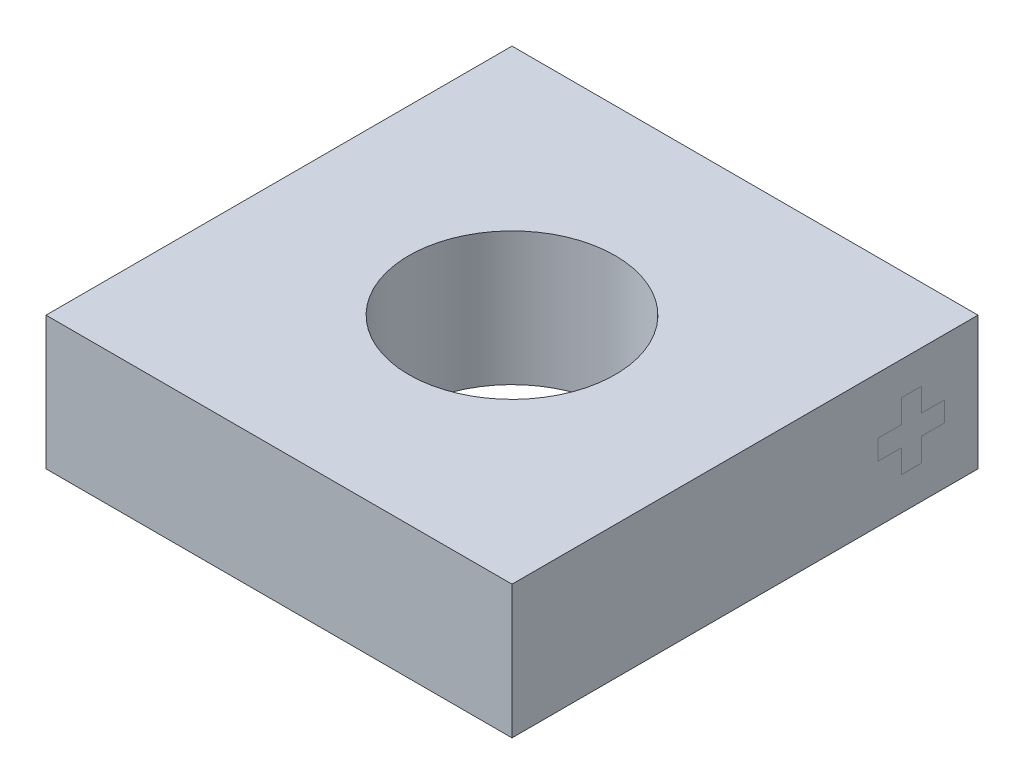
ISO-10303-21;
HEADER;
FILE_DESCRIPTION(('STEP AP214'),'2;1');
FILE_NAME('part.step','',(''),(''),'','','');
FILE_SCHEMA(('AUTOMOTIVE_DESIGN { 1 0 10303 214 1 1 1 1 }'));
ENDSEC;
DATA;
#1=APPLICATION_CONTEXT('core data for automotive mechanical design processes');
#2=APPLICATION_PROTOCOL_DEFINITION('international standard','automotive_design',2000,#1);
#3=PRODUCT_CONTEXT('',#1,'mechanical');
#4=PRODUCT('Part','Part','',(#3));
#5=PRODUCT_RELATED_PRODUCT_CATEGORY('part','',(#4));
#6=PRODUCT_DEFINITION_FORMATION('','',#4);
#7=PRODUCT_DEFINITION_CONTEXT('part definition',#1,'design');
#8=PRODUCT_DEFINITION('design','',#6,#7);
#9=PRODUCT_DEFINITION_SHAPE('','',#8);
#10=(LENGTH_UNIT() NAMED_UNIT(*) SI_UNIT(.MILLI.,.METRE.));
#11=(NAMED_UNIT(*) PLANE_ANGLE_UNIT() SI_UNIT($,.RADIAN.));
#12=(NAMED_UNIT(*) SI_UNIT($,.STERADIAN.) SOLID_ANGLE_UNIT());
#13=UNCERTAINTY_MEASURE_WITH_UNIT(LENGTH_MEASURE(1.E-05),#10,'distance_accuracy_value','');
#14=(GEOMETRIC_REPRESENTATION_CONTEXT(3) GLOBAL_UNCERTAINTY_ASSIGNED_CONTEXT((#13)) GLOBAL_UNIT_ASSIGNED_CONTEXT((#10,
#11,#12)) REPRESENTATION_CONTEXT('',''));
#15=CARTESIAN_POINT('',(0.,0.,0.));
#16=DIRECTION('',(0.,0.,1.));
#17=DIRECTION('',(1.,0.,0.));
#18=AXIS2_PLACEMENT_3D('',#15,#16,#17);
#19=CARTESIAN_POINT('',(3.5,2.,-3.5));
#20=DIRECTION('',(-1.,0.,0.));
#21=DIRECTION('',(0.,0.,1.));
#22=AXIS2_PLACEMENT_3D('',#19,#20,#21);
#23=PLANE('',#22);
#24=DIRECTION('',(0.,-1.,0.));
#25=VECTOR('',#24,1.);
#26=CARTESIAN_POINT('',(3.5,0.850000000000002,-2.35));
#27=LINE('',#26,#25);
#28=CARTESIAN_POINT('',(3.5,0.850000000000002,-2.35));
#29=VERTEX_POINT('',#28);
#30=CARTESIAN_POINT('',(3.5,0.500000000000002,-2.35));
#31=VERTEX_POINT('',#30);
#32=EDGE_CURVE('E457',#29,#31,#27,.T.);
#33=ORIENTED_EDGE('',*,*,#32,.T.);
#34=DIRECTION('',(0.,0.,-1.));
#35=VECTOR('',#34,1.);
#36=CARTESIAN_POINT('',(3.5,0.500000000000002,-2.35));
#37=LINE('',#36,#35);
#38=CARTESIAN_POINT('',(3.5,0.500000000000002,-2.65));
#39=VERTEX_POINT('',#38);
#40=EDGE_CURVE('E13',#31,#39,#37,.T.);
#41=ORIENTED_EDGE('',*,*,#40,.T.);
#42=DIRECTION('',(0.,1.,0.));
#43=VECTOR('',#42,1.);
#44=CARTESIAN_POINT('',(3.5,0.850000000000002,-2.65));
#45=LINE('',#44,#43);
#46=CARTESIAN_POINT('',(3.5,0.850000000000002,-2.65));
#47=VERTEX_POINT('',#46);
#48=EDGE_CURVE('E366',#39,#47,#45,.T.);
#49=ORIENTED_EDGE('',*,*,#48,.T.);
#50=DIRECTION('',(0.,0.,-1.));
#51=VECTOR('',#50,1.);
#52=CARTESIAN_POINT('',(3.5,0.850000000000002,-2.65));
#53=LINE('',#52,#51);
#54=CARTESIAN_POINT('',(3.5,0.850000000000002,-3.));
#55=VERTEX_POINT('',#54);
#56=EDGE_CURVE('E490',#47,#55,#53,.T.);
#57=ORIENTED_EDGE('',*,*,#56,.T.);
#58=DIRECTION('',(0.,1.,0.));
#59=VECTOR('',#58,1.);
#60=CARTESIAN_POINT('',(3.5,1.15,-3.));
#61=LINE('',#60,#59);
#62=CARTESIAN_POINT('',(3.5,1.15,-3.));
#63=VERTEX_POINT('',#62);
#64=EDGE_CURVE('E487',#55,#63,#61,.T.);
#65=ORIENTED_EDGE('',*,*,#64,.T.);
#66=DIRECTION('',(0.,0.,1.));
#67=VECTOR('',#66,1.);
#68=CARTESIAN_POINT('',(3.5,1.15,-2.65));
#69=LINE('',#68,#67);
#70=CARTESIAN_POINT('',(3.5,1.15,-2.65));
#71=VERTEX_POINT('',#70);
#72=EDGE_CURVE('E484',#63,#71,#69,.T.);
#73=ORIENTED_EDGE('',*,*,#72,.T.);
#74=DIRECTION('',(0.,1.,0.));
#75=VECTOR('',#74,1.);
#76=CARTESIAN_POINT('',(3.5,1.5,-2.65));
#77=LINE('',#76,#75);
#78=CARTESIAN_POINT('',(3.5,1.5,-2.65));
#79=VERTEX_POINT('',#78);
#80=EDGE_CURVE('E481',#71,#79,#77,.T.);
#81=ORIENTED_EDGE('',*,*,#80,.T.);
#82=DIRECTION('',(0.,0.,1.));
#83=VECTOR('',#82,1.);
#84=CARTESIAN_POINT('',(3.5,1.5,-2.35));
#85=LINE('',#84,#83);
#86=CARTESIAN_POINT('',(3.5,1.5,-2.35));
#87=VERTEX_POINT('',#86);
#88=EDGE_CURVE('E478',#79,#87,#85,.T.);
#89=ORIENTED_EDGE('',*,*,#88,.T.);
#90=DIRECTION('',(0.,-1.,0.));
#91=VECTOR('',#90,1.);
#92=CARTESIAN_POINT('',(3.5,1.5,-2.35));
#93=LINE('',#92,#91);
#94=CARTESIAN_POINT('',(3.5,1.15,-2.35));
#95=VERTEX_POINT('',#94);
#96=EDGE_CURVE('E475',#87,#95,#93,.T.);
#97=ORIENTED_EDGE('',*,*,#96,.T.);
#98=DIRECTION('',(0.,0.,1.));
#99=VECTOR('',#98,1.);
#100=CARTESIAN_POINT('',(3.5,1.15,-2.));
#101=LINE('',#100,#99);
#102=CARTESIAN_POINT('',(3.5,1.15,-2.));
#103=VERTEX_POINT('',#102);
#104=EDGE_CURVE('E473',#95,#103,#101,.T.);
#105=ORIENTED_EDGE('',*,*,#104,.T.);
#106=DIRECTION('',(0.,-1.,0.));
#107=VECTOR('',#106,1.);
#108=CARTESIAN_POINT('',(3.5,1.15,-2.));
#109=LINE('',#108,#107);
#110=CARTESIAN_POINT('',(3.5,0.850000000000002,-2.));
#111=VERTEX_POINT('',#110);
#112=EDGE_CURVE('E470',#103,#111,#109,.T.);
#113=ORIENTED_EDGE('',*,*,#112,.T.);
#114=DIRECTION('',(0.,0.,-1.));
#115=VECTOR('',#114,1.);
#116=CARTESIAN_POINT('',(3.5,0.850000000000002,-2.));
#117=LINE('',#116,#115);
#118=EDGE_CURVE('E462',#111,#29,#117,.T.);
#119=ORIENTED_EDGE('',*,*,#118,.T.);
#120=EDGE_LOOP('',(#33,#41,#49,#57,#65,#73,#81,#89,#97,#105,#113,#119));
#121=FACE_BOUND('',#120,.T.);
#122=ADVANCED_FACE('F356',(#121),#23,.F.);
#123=CARTESIAN_POINT('',(-3.5,2.,-3.5));
#124=DIRECTION('',(1.,0.,0.));
#125=DIRECTION('',(0.,0.,-1.));
#126=AXIS2_PLACEMENT_3D('',#123,#124,#125);
#127=PLANE('',#126);
#128=DIRECTION('',(0.,0.,1.));
#129=VECTOR('',#128,1.);
#130=CARTESIAN_POINT('',(-3.5,0.,-3.5));
#131=LINE('',#130,#129);
#132=CARTESIAN_POINT('',(-3.5,0.,-3.5));
#133=VERTEX_POINT('',#132);
#134=CARTESIAN_POINT('',(-3.5,0.,3.5));
#135=VERTEX_POINT('',#134);
#136=EDGE_CURVE('E455',#133,#135,#131,.T.);
#137=ORIENTED_EDGE('',*,*,#136,.T.);
#138=DIRECTION('',(0.,-1.,0.));
#139=VECTOR('',#138,1.);
#140=CARTESIAN_POINT('',(-3.5,2.,3.5));
#141=LINE('',#140,#139);
#142=CARTESIAN_POINT('',(-3.5,2.,3.5));
#143=VERTEX_POINT('',#142);
#144=EDGE_CURVE('E434',#143,#135,#141,.T.);
#145=ORIENTED_EDGE('',*,*,#144,.F.);
#146=DIRECTION('',(0.,0.,1.));
#147=VECTOR('',#146,1.);
#148=CARTESIAN_POINT('',(-3.5,2.,-3.5));
#149=LINE('',#148,#147);
#150=CARTESIAN_POINT('',(-3.5,2.,-3.5));
#151=VERTEX_POINT('',#150);
#152=EDGE_CURVE('E442',#151,#143,#149,.T.);
#153=ORIENTED_EDGE('',*,*,#152,.F.);
#154=DIRECTION('',(0.,-1.,0.));
#155=VECTOR('',#154,1.);
#156=CARTESIAN_POINT('',(-3.5,2.,-3.5));
#157=LINE('',#156,#155);
#158=EDGE_CURVE('E509',#151,#133,#157,.T.);
#159=ORIENTED_EDGE('',*,*,#158,.T.);
#160=EDGE_LOOP('',(#137,#145,#153,#159));
#161=FACE_BOUND('',#160,.T.);
#162=ADVANCED_FACE('F358',(#161),#127,.F.);
#163=CARTESIAN_POINT('',(-3.5,2.,3.5));
#164=DIRECTION('',(0.,0.,-1.));
#165=DIRECTION('',(-1.,0.,0.));
#166=AXIS2_PLACEMENT_3D('',#163,#164,#165);
#167=PLANE('',#166);
#168=DIRECTION('',(1.,0.,0.));
#169=VECTOR('',#168,1.);
#170=CARTESIAN_POINT('',(-3.5,0.,3.5));
#171=LINE('',#170,#169);
#172=CARTESIAN_POINT('',(3.5,0.,3.5));
#173=VERTEX_POINT('',#172);
#174=EDGE_CURVE('E513',#135,#173,#171,.T.);
#175=ORIENTED_EDGE('',*,*,#174,.T.);
#176=DIRECTION('',(0.,-1.,0.));
#177=VECTOR('',#176,1.);
#178=CARTESIAN_POINT('',(3.5,2.,3.5));
#179=LINE('',#178,#177);
#180=CARTESIAN_POINT('',(3.5,2.,3.5));
#181=VERTEX_POINT('',#180);
#182=EDGE_CURVE('E437',#181,#173,#179,.T.);
#183=ORIENTED_EDGE('',*,*,#182,.F.);
#184=DIRECTION('',(1.,0.,0.));
#185=VECTOR('',#184,1.);
#186=CARTESIAN_POINT('',(-3.5,2.,3.5));
#187=LINE('',#186,#185);
#188=EDGE_CURVE('E430',#143,#181,#187,.T.);
#189=ORIENTED_EDGE('',*,*,#188,.F.);
#190=ORIENTED_EDGE('',*,*,#144,.T.);
#191=EDGE_LOOP('',(#175,#183,#189,#190));
#192=FACE_BOUND('',#191,.T.);
#193=ADVANCED_FACE('F432',(#192),#167,.F.);
#194=ORIENTED_EDGE('',*,*,#40,.F.);
#195=ORIENTED_EDGE('',*,*,#32,.F.);
#196=ORIENTED_EDGE('',*,*,#118,.F.);
#197=ORIENTED_EDGE('',*,*,#112,.F.);
#198=ORIENTED_EDGE('',*,*,#104,.F.);
#199=ORIENTED_EDGE('',*,*,#96,.F.);
#200=ORIENTED_EDGE('',*,*,#88,.F.);
#201=ORIENTED_EDGE('',*,*,#80,.F.);
#202=ORIENTED_EDGE('',*,*,#72,.F.);
#203=ORIENTED_EDGE('',*,*,#64,.F.);
#204=ORIENTED_EDGE('',*,*,#56,.F.);
#205=ORIENTED_EDGE('',*,*,#48,.F.);
#206=EDGE_LOOP('',(#194,#195,#196,#197,#198,#199,#200,#201,#202,#203,#204,#205));
#207=FACE_BOUND('',#206,.T.);
#208=DIRECTION('',(0.,0.,-1.));
#209=VECTOR('',#208,1.);
#210=CARTESIAN_POINT('',(3.5,0.,-3.5));
#211=LINE('',#210,#209);
#212=CARTESIAN_POINT('',(3.5,0.,-3.5));
#213=VERTEX_POINT('',#212);
#214=EDGE_CURVE('E512',#173,#213,#211,.T.);
#215=ORIENTED_EDGE('',*,*,#214,.T.);
#216=DIRECTION('',(0.,-1.,0.));
#217=VECTOR('',#216,1.);
#218=CARTESIAN_POINT('',(3.5,2.,-3.5));
#219=LINE('',#218,#217);
#220=CARTESIAN_POINT('',(3.5,2.,-3.5));
#221=VERTEX_POINT('',#220);
#222=EDGE_CURVE('E464',#221,#213,#219,.T.);
#223=ORIENTED_EDGE('',*,*,#222,.F.);
#224=DIRECTION('',(0.,0.,-1.));
#225=VECTOR('',#224,1.);
#226=CARTESIAN_POINT('',(3.5,2.,-3.5));
#227=LINE('',#226,#225);
#228=EDGE_CURVE('E441',#181,#221,#227,.T.);
#229=ORIENTED_EDGE('',*,*,#228,.F.);
#230=ORIENTED_EDGE('',*,*,#182,.T.);
#231=EDGE_LOOP('',(#215,#223,#229,#230));
#232=FACE_BOUND('',#231,.T.);
#233=ADVANCED_FACE('F558',(#207,#232),#23,.F.);
#234=CARTESIAN_POINT('',(-3.5,2.,-3.5));
#235=DIRECTION('',(0.,0.,1.));
#236=DIRECTION('',(1.,0.,0.));
#237=AXIS2_PLACEMENT_3D('',#234,#235,#236);
#238=PLANE('',#237);
#239=DIRECTION('',(-1.,0.,0.));
#240=VECTOR('',#239,1.);
#241=CARTESIAN_POINT('',(-3.5,0.,-3.5));
#242=LINE('',#241,#240);
#243=EDGE_CURVE('E452',#213,#133,#242,.T.);
#244=ORIENTED_EDGE('',*,*,#243,.T.);
#245=ORIENTED_EDGE('',*,*,#158,.F.);
#246=DIRECTION('',(-1.,0.,0.));
#247=VECTOR('',#246,1.);
#248=CARTESIAN_POINT('',(-3.5,2.,-3.5));
#249=LINE('',#248,#247);
#250=EDGE_CURVE('E447',#221,#151,#249,.T.);
#251=ORIENTED_EDGE('',*,*,#250,.F.);
#252=ORIENTED_EDGE('',*,*,#222,.T.);
#253=EDGE_LOOP('',(#244,#245,#251,#252));
#254=FACE_BOUND('',#253,.T.);
#255=ADVANCED_FACE('F553',(#254),#238,.F.);
#256=CARTESIAN_POINT('',(0.,2.,0.));
#257=DIRECTION('',(0.,1.,0.));
#258=DIRECTION('',(0.,0.,1.));
#259=AXIS2_PLACEMENT_3D('',#256,#257,#258);
#260=PLANE('',#259);
#261=CARTESIAN_POINT('',(0.,2.,0.));
#262=DIRECTION('',(0.,1.,0.));
#263=DIRECTION('',(0.,0.,1.));
#264=AXIS2_PLACEMENT_3D('',#261,#262,#263);
#265=CIRCLE('',#264,1.55);
#266=CARTESIAN_POINT('',(0.,2.,1.55));
#267=VERTEX_POINT('',#266);
#268=EDGE_CURVE('E547',#267,#267,#265,.T.);
#269=ORIENTED_EDGE('',*,*,#268,.F.);
#270=EDGE_LOOP('',(#269));
#271=FACE_BOUND('',#270,.T.);
#272=ORIENTED_EDGE('',*,*,#152,.T.);
#273=ORIENTED_EDGE('',*,*,#188,.T.);
#274=ORIENTED_EDGE('',*,*,#228,.T.);
#275=ORIENTED_EDGE('',*,*,#250,.T.);
#276=EDGE_LOOP('',(#272,#273,#274,#275));
#277=FACE_BOUND('',#276,.T.);
#278=ADVANCED_FACE('F445',(#271,#277),#260,.T.);
#279=CARTESIAN_POINT('',(0.,0.,0.));
#280=DIRECTION('',(0.,1.,0.));
#281=DIRECTION('',(0.,0.,1.));
#282=AXIS2_PLACEMENT_3D('',#279,#280,#281);
#283=PLANE('',#282);
#284=CARTESIAN_POINT('',(0.,0.,0.));
#285=DIRECTION('',(0.,1.,0.));
#286=DIRECTION('',(0.,0.,1.));
#287=AXIS2_PLACEMENT_3D('',#284,#285,#286);
#288=CIRCLE('',#287,1.55);
#289=CARTESIAN_POINT('',(0.,0.,1.55));
#290=VERTEX_POINT('',#289);
#291=EDGE_CURVE('E360',#290,#290,#288,.T.);
#292=ORIENTED_EDGE('',*,*,#291,.T.);
#293=EDGE_LOOP('',(#292));
#294=FACE_BOUND('',#293,.T.);
#295=ORIENTED_EDGE('',*,*,#136,.F.);
#296=ORIENTED_EDGE('',*,*,#243,.F.);
#297=ORIENTED_EDGE('',*,*,#214,.F.);
#298=ORIENTED_EDGE('',*,*,#174,.F.);
#299=EDGE_LOOP('',(#295,#296,#297,#298));
#300=FACE_BOUND('',#299,.T.);
#301=ADVANCED_FACE('F557',(#294,#300),#283,.F.);
#302=CARTESIAN_POINT('',(0.,-7.9999,0.));
#303=DIRECTION('',(0.,1.,0.));
#304=DIRECTION('',(0.,0.,1.));
#305=AXIS2_PLACEMENT_3D('',#302,#303,#304);
#306=CYLINDRICAL_SURFACE('',#305,1.55);
#307=ORIENTED_EDGE('',*,*,#268,.T.);
#308=EDGE_LOOP('',(#307));
#309=FACE_BOUND('',#308,.T.);
#310=ORIENTED_EDGE('',*,*,#291,.F.);
#311=EDGE_LOOP('',(#310));
#312=FACE_BOUND('',#311,.T.);
#313=ADVANCED_FACE('F612',(#309,#312),#306,.F.);
#314=CLOSED_SHELL('',(#122,#162,#193,#233,#255,#278,#301,#313));
#315=MANIFOLD_SOLID_BREP('B2',#314);
#316=ADVANCED_BREP_SHAPE_REPRESENTATION('',(#18,#315),#14);
#317=SHAPE_DEFINITION_REPRESENTATION(#9,#316);
ENDSEC;
END-ISO-10303-21;
